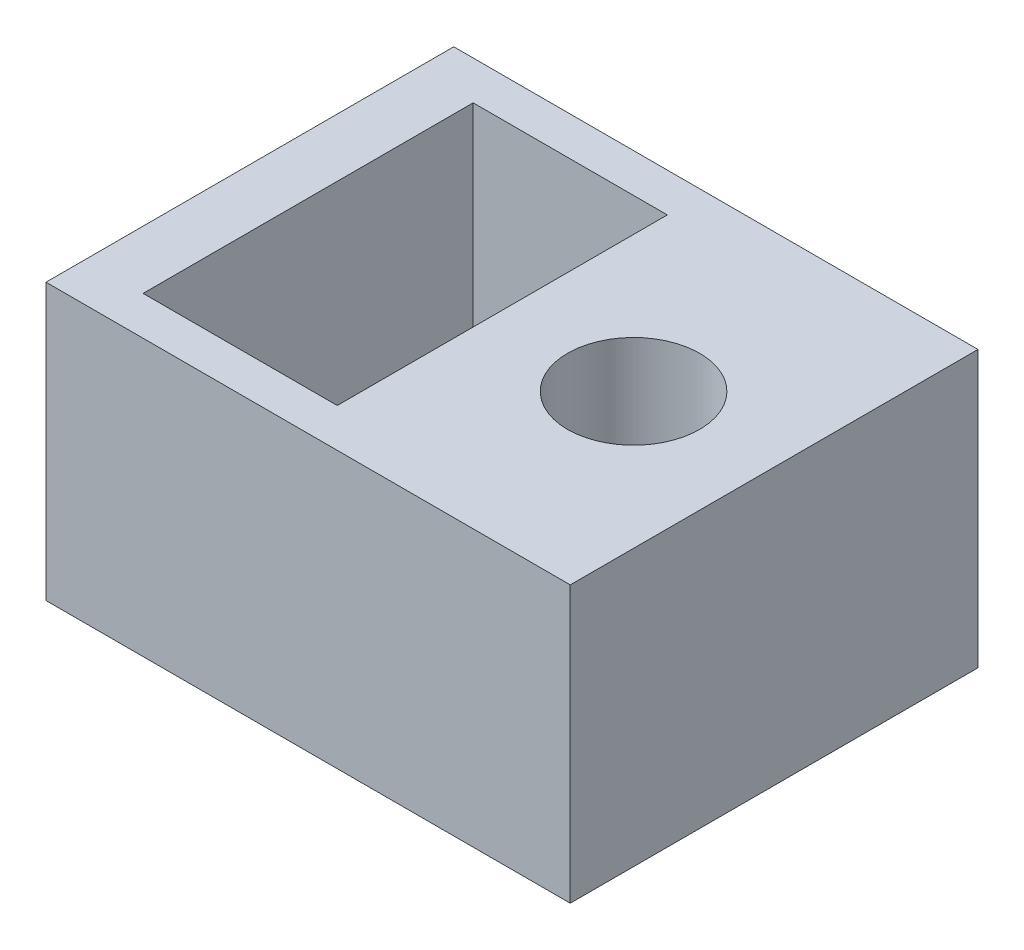
ISO-10303-21;
HEADER;
FILE_DESCRIPTION(('STEP AP214'),'2;1');
FILE_NAME('part.step','',(''),(''),'','','');
FILE_SCHEMA(('AUTOMOTIVE_DESIGN { 1 0 10303 214 1 1 1 1 }'));
ENDSEC;
DATA;
#1=APPLICATION_CONTEXT('core data for automotive mechanical design processes');
#2=APPLICATION_PROTOCOL_DEFINITION('international standard','automotive_design',2000,#1);
#3=PRODUCT_CONTEXT('',#1,'mechanical');
#4=PRODUCT('Part','Part','',(#3));
#5=PRODUCT_RELATED_PRODUCT_CATEGORY('part','',(#4));
#6=PRODUCT_DEFINITION_FORMATION('','',#4);
#7=PRODUCT_DEFINITION_CONTEXT('part definition',#1,'design');
#8=PRODUCT_DEFINITION('design','',#6,#7);
#9=PRODUCT_DEFINITION_SHAPE('','',#8);
#10=(LENGTH_UNIT() NAMED_UNIT(*) SI_UNIT(.MILLI.,.METRE.));
#11=(NAMED_UNIT(*) PLANE_ANGLE_UNIT() SI_UNIT($,.RADIAN.));
#12=(NAMED_UNIT(*) SI_UNIT($,.STERADIAN.) SOLID_ANGLE_UNIT());
#13=UNCERTAINTY_MEASURE_WITH_UNIT(LENGTH_MEASURE(1.E-05),#10,'distance_accuracy_value','');
#14=(GEOMETRIC_REPRESENTATION_CONTEXT(3) GLOBAL_UNCERTAINTY_ASSIGNED_CONTEXT((#13)) GLOBAL_UNIT_ASSIGNED_CONTEXT((#10,
#11,#12)) REPRESENTATION_CONTEXT('',''));
#15=CARTESIAN_POINT('',(0.,0.,0.));
#16=DIRECTION('',(0.,0.,1.));
#17=DIRECTION('',(1.,0.,0.));
#18=AXIS2_PLACEMENT_3D('',#15,#16,#17);
#19=CARTESIAN_POINT('',(0.,7.1,0.));
#20=DIRECTION('',(0.,-1.,0.));
#21=DIRECTION('',(0.,0.,-1.));
#22=AXIS2_PLACEMENT_3D('',#19,#20,#21);
#23=PLANE('',#22);
#24=DIRECTION('',(0.,0.,1.));
#25=VECTOR('',#24,1.);
#26=CARTESIAN_POINT('',(9.60529294047567,7.1,-2.45570042210062));
#27=LINE('',#26,#25);
#28=CARTESIAN_POINT('',(9.60529294047567,7.1,-2.45570042210062));
#29=VERTEX_POINT('',#28);
#30=CARTESIAN_POINT('',(9.60529294047568,7.1,6.04429957789938));
#31=VERTEX_POINT('',#30);
#32=EDGE_CURVE('E147',#29,#31,#27,.T.);
#33=ORIENTED_EDGE('',*,*,#32,.F.);
#34=DIRECTION('',(-1.,0.,0.));
#35=VECTOR('',#34,1.);
#36=CARTESIAN_POINT('',(14.6052929404757,7.1,-2.45570042210062));
#37=LINE('',#36,#35);
#38=CARTESIAN_POINT('',(14.6052929404757,7.1,-2.45570042210062));
#39=VERTEX_POINT('',#38);
#40=EDGE_CURVE('E140',#39,#29,#37,.T.);
#41=ORIENTED_EDGE('',*,*,#40,.F.);
#42=DIRECTION('',(0.,0.,-1.));
#43=VECTOR('',#42,1.);
#44=CARTESIAN_POINT('',(14.6052929404757,7.1,6.04429957789938));
#45=LINE('',#44,#43);
#46=CARTESIAN_POINT('',(14.6052929404757,7.1,6.04429957789938));
#47=VERTEX_POINT('',#46);
#48=EDGE_CURVE('E151',#47,#39,#45,.T.);
#49=ORIENTED_EDGE('',*,*,#48,.F.);
#50=DIRECTION('',(1.,0.,0.));
#51=VECTOR('',#50,1.);
#52=CARTESIAN_POINT('',(9.60529294047568,7.1,6.04429957789938));
#53=LINE('',#52,#51);
#54=EDGE_CURVE('E50',#31,#47,#53,.T.);
#55=ORIENTED_EDGE('',*,*,#54,.F.);
#56=EDGE_LOOP('',(#33,#41,#49,#55));
#57=FACE_BOUND('',#56,.T.);
#58=CARTESIAN_POINT('',(18.1052929404757,7.1,1.91320120605374));
#59=DIRECTION('',(0.,1.,0.));
#60=DIRECTION('',(0.,0.,1.));
#61=AXIS2_PLACEMENT_3D('',#58,#59,#60);
#62=CIRCLE('',#61,1.7);
#63=CARTESIAN_POINT('',(18.1052929404757,7.1,3.61320120605374));
#64=VERTEX_POINT('',#63);
#65=EDGE_CURVE('E187',#64,#64,#62,.T.);
#66=ORIENTED_EDGE('',*,*,#65,.F.);
#67=EDGE_LOOP('',(#66));
#68=FACE_BOUND('',#67,.T.);
#69=DIRECTION('',(0.,0.,1.));
#70=VECTOR('',#69,1.);
#71=CARTESIAN_POINT('',(8.10529294047567,7.1,7.04429957789938));
#72=LINE('',#71,#70);
#73=CARTESIAN_POINT('',(8.10529294047567,7.1,-3.45570042210062));
#74=VERTEX_POINT('',#73);
#75=CARTESIAN_POINT('',(8.10529294047567,7.1,7.04429957789938));
#76=VERTEX_POINT('',#75);
#77=EDGE_CURVE('E193',#74,#76,#72,.T.);
#78=ORIENTED_EDGE('',*,*,#77,.T.);
#79=DIRECTION('',(1.,0.,0.));
#80=VECTOR('',#79,1.);
#81=CARTESIAN_POINT('',(8.10529294047567,7.1,7.04429957789938));
#82=LINE('',#81,#80);
#83=CARTESIAN_POINT('',(21.6052929404757,7.1,7.04429957789938));
#84=VERTEX_POINT('',#83);
#85=EDGE_CURVE('E196',#76,#84,#82,.T.);
#86=ORIENTED_EDGE('',*,*,#85,.T.);
#87=DIRECTION('',(0.,0.,-1.));
#88=VECTOR('',#87,1.);
#89=CARTESIAN_POINT('',(21.6052929404757,7.1,7.04429957789938));
#90=LINE('',#89,#88);
#91=CARTESIAN_POINT('',(21.6052929404757,7.1,-3.45570042210062));
#92=VERTEX_POINT('',#91);
#93=EDGE_CURVE('E199',#84,#92,#90,.T.);
#94=ORIENTED_EDGE('',*,*,#93,.T.);
#95=DIRECTION('',(-1.,0.,0.));
#96=VECTOR('',#95,1.);
#97=CARTESIAN_POINT('',(8.10529294047567,7.1,-3.45570042210062));
#98=LINE('',#97,#96);
#99=EDGE_CURVE('E201',#92,#74,#98,.T.);
#100=ORIENTED_EDGE('',*,*,#99,.T.);
#101=EDGE_LOOP('',(#78,#86,#94,#100));
#102=FACE_BOUND('',#101,.T.);
#103=ADVANCED_FACE('F35',(#57,#68,#102),#23,.F.);
#104=CARTESIAN_POINT('',(0.,0.,0.));
#105=DIRECTION('',(0.,-1.,0.));
#106=DIRECTION('',(0.,0.,-1.));
#107=AXIS2_PLACEMENT_3D('',#104,#105,#106);
#108=PLANE('',#107);
#109=DIRECTION('',(0.,0.,1.));
#110=VECTOR('',#109,1.);
#111=CARTESIAN_POINT('',(8.10529294047567,0.,7.04429957789938));
#112=LINE('',#111,#110);
#113=CARTESIAN_POINT('',(8.10529294047567,0.,-3.45570042210062));
#114=VERTEX_POINT('',#113);
#115=CARTESIAN_POINT('',(8.10529294047567,0.,7.04429957789938));
#116=VERTEX_POINT('',#115);
#117=EDGE_CURVE('E190',#114,#116,#112,.T.);
#118=ORIENTED_EDGE('',*,*,#117,.F.);
#119=DIRECTION('',(-1.,0.,0.));
#120=VECTOR('',#119,1.);
#121=CARTESIAN_POINT('',(8.10529294047567,0.,-3.45570042210062));
#122=LINE('',#121,#120);
#123=CARTESIAN_POINT('',(21.6052929404757,0.,-3.45570042210062));
#124=VERTEX_POINT('',#123);
#125=EDGE_CURVE('E197',#124,#114,#122,.T.);
#126=ORIENTED_EDGE('',*,*,#125,.F.);
#127=DIRECTION('',(0.,0.,-1.));
#128=VECTOR('',#127,1.);
#129=CARTESIAN_POINT('',(21.6052929404757,0.,7.04429957789938));
#130=LINE('',#129,#128);
#131=CARTESIAN_POINT('',(21.6052929404757,0.,7.04429957789938));
#132=VERTEX_POINT('',#131);
#133=EDGE_CURVE('E208',#132,#124,#130,.T.);
#134=ORIENTED_EDGE('',*,*,#133,.F.);
#135=DIRECTION('',(1.,0.,0.));
#136=VECTOR('',#135,1.);
#137=CARTESIAN_POINT('',(8.10529294047567,0.,7.04429957789938));
#138=LINE('',#137,#136);
#139=EDGE_CURVE('E206',#116,#132,#138,.T.);
#140=ORIENTED_EDGE('',*,*,#139,.F.);
#141=EDGE_LOOP('',(#118,#126,#134,#140));
#142=FACE_BOUND('',#141,.T.);
#143=CARTESIAN_POINT('',(18.1052929404757,0.,1.91320120605374));
#144=DIRECTION('',(0.,1.,0.));
#145=DIRECTION('',(0.,0.,1.));
#146=AXIS2_PLACEMENT_3D('',#143,#144,#145);
#147=CIRCLE('',#146,1.7);
#148=CARTESIAN_POINT('',(18.1052929404757,0.,3.61320120605374));
#149=VERTEX_POINT('',#148);
#150=EDGE_CURVE('E186',#149,#149,#147,.T.);
#151=ORIENTED_EDGE('',*,*,#150,.T.);
#152=EDGE_LOOP('',(#151));
#153=FACE_BOUND('',#152,.T.);
#154=DIRECTION('',(0.,0.,-1.));
#155=VECTOR('',#154,1.);
#156=CARTESIAN_POINT('',(13.6052929404757,0.,-1.45570042210062));
#157=LINE('',#156,#155);
#158=CARTESIAN_POINT('',(13.6052929404757,0.,5.04429957789938));
#159=VERTEX_POINT('',#158);
#160=CARTESIAN_POINT('',(13.6052929404757,0.,-1.45570042210062));
#161=VERTEX_POINT('',#160);
#162=EDGE_CURVE('E175',#159,#161,#157,.T.);
#163=ORIENTED_EDGE('',*,*,#162,.T.);
#164=DIRECTION('',(-1.,0.,0.));
#165=VECTOR('',#164,1.);
#166=CARTESIAN_POINT('',(10.6052929404757,0.,-1.45570042210062));
#167=LINE('',#166,#165);
#168=CARTESIAN_POINT('',(10.6052929404757,0.,-1.45570042210062));
#169=VERTEX_POINT('',#168);
#170=EDGE_CURVE('E166',#161,#169,#167,.T.);
#171=ORIENTED_EDGE('',*,*,#170,.T.);
#172=DIRECTION('',(0.,0.,1.));
#173=VECTOR('',#172,1.);
#174=CARTESIAN_POINT('',(10.6052929404757,0.,-1.45570042210062));
#175=LINE('',#174,#173);
#176=CARTESIAN_POINT('',(10.6052929404757,0.,5.04429957789938));
#177=VERTEX_POINT('',#176);
#178=EDGE_CURVE('E169',#169,#177,#175,.T.);
#179=ORIENTED_EDGE('',*,*,#178,.T.);
#180=DIRECTION('',(1.,0.,0.));
#181=VECTOR('',#180,1.);
#182=CARTESIAN_POINT('',(10.6052929404757,0.,5.04429957789938));
#183=LINE('',#182,#181);
#184=EDGE_CURVE('E172',#177,#159,#183,.T.);
#185=ORIENTED_EDGE('',*,*,#184,.T.);
#186=EDGE_LOOP('',(#163,#171,#179,#185));
#187=FACE_BOUND('',#186,.T.);
#188=ADVANCED_FACE('F229',(#142,#153,#187),#108,.T.);
#189=CARTESIAN_POINT('',(8.10529294047567,7.1,7.04429957789938));
#190=DIRECTION('',(1.,0.,0.));
#191=DIRECTION('',(0.,0.,-1.));
#192=AXIS2_PLACEMENT_3D('',#189,#190,#191);
#193=PLANE('',#192);
#194=ORIENTED_EDGE('',*,*,#117,.T.);
#195=DIRECTION('',(0.,-1.,0.));
#196=VECTOR('',#195,1.);
#197=CARTESIAN_POINT('',(8.10529294047567,7.1,7.04429957789938));
#198=LINE('',#197,#196);
#199=EDGE_CURVE('E43',#76,#116,#198,.T.);
#200=ORIENTED_EDGE('',*,*,#199,.F.);
#201=ORIENTED_EDGE('',*,*,#77,.F.);
#202=DIRECTION('',(0.,-1.,0.));
#203=VECTOR('',#202,1.);
#204=CARTESIAN_POINT('',(8.10529294047567,7.1,-3.45570042210062));
#205=LINE('',#204,#203);
#206=EDGE_CURVE('E203',#74,#114,#205,.T.);
#207=ORIENTED_EDGE('',*,*,#206,.T.);
#208=EDGE_LOOP('',(#194,#200,#201,#207));
#209=FACE_BOUND('',#208,.T.);
#210=ADVANCED_FACE('F37',(#209),#193,.F.);
#211=CARTESIAN_POINT('',(8.10529294047567,7.1,7.04429957789938));
#212=DIRECTION('',(0.,0.,-1.));
#213=DIRECTION('',(-1.,0.,0.));
#214=AXIS2_PLACEMENT_3D('',#211,#212,#213);
#215=PLANE('',#214);
#216=ORIENTED_EDGE('',*,*,#139,.T.);
#217=DIRECTION('',(0.,-1.,0.));
#218=VECTOR('',#217,1.);
#219=CARTESIAN_POINT('',(21.6052929404757,7.1,7.04429957789938));
#220=LINE('',#219,#218);
#221=EDGE_CURVE('E216',#84,#132,#220,.T.);
#222=ORIENTED_EDGE('',*,*,#221,.F.);
#223=ORIENTED_EDGE('',*,*,#85,.F.);
#224=ORIENTED_EDGE('',*,*,#199,.T.);
#225=EDGE_LOOP('',(#216,#222,#223,#224));
#226=FACE_BOUND('',#225,.T.);
#227=ADVANCED_FACE('F221',(#226),#215,.F.);
#228=CARTESIAN_POINT('',(21.6052929404757,7.1,7.04429957789938));
#229=DIRECTION('',(-1.,0.,0.));
#230=DIRECTION('',(0.,0.,1.));
#231=AXIS2_PLACEMENT_3D('',#228,#229,#230);
#232=PLANE('',#231);
#233=ORIENTED_EDGE('',*,*,#133,.T.);
#234=DIRECTION('',(0.,-1.,0.));
#235=VECTOR('',#234,1.);
#236=CARTESIAN_POINT('',(21.6052929404757,7.1,-3.45570042210062));
#237=LINE('',#236,#235);
#238=EDGE_CURVE('E213',#92,#124,#237,.T.);
#239=ORIENTED_EDGE('',*,*,#238,.F.);
#240=ORIENTED_EDGE('',*,*,#93,.F.);
#241=ORIENTED_EDGE('',*,*,#221,.T.);
#242=EDGE_LOOP('',(#233,#239,#240,#241));
#243=FACE_BOUND('',#242,.T.);
#244=ADVANCED_FACE('F234',(#243),#232,.F.);
#245=CARTESIAN_POINT('',(8.10529294047567,7.1,-3.45570042210062));
#246=DIRECTION('',(0.,0.,1.));
#247=DIRECTION('',(1.,0.,0.));
#248=AXIS2_PLACEMENT_3D('',#245,#246,#247);
#249=PLANE('',#248);
#250=ORIENTED_EDGE('',*,*,#125,.T.);
#251=ORIENTED_EDGE('',*,*,#206,.F.);
#252=ORIENTED_EDGE('',*,*,#99,.F.);
#253=ORIENTED_EDGE('',*,*,#238,.T.);
#254=EDGE_LOOP('',(#250,#251,#252,#253));
#255=FACE_BOUND('',#254,.T.);
#256=ADVANCED_FACE('F238',(#255),#249,.F.);
#257=CARTESIAN_POINT('',(18.1052929404757,7.1,1.91320120605374));
#258=DIRECTION('',(0.,-1.,0.));
#259=DIRECTION('',(0.,0.,-1.));
#260=AXIS2_PLACEMENT_3D('',#257,#258,#259);
#261=CYLINDRICAL_SURFACE('',#260,1.7);
#262=ORIENTED_EDGE('',*,*,#65,.T.);
#263=EDGE_LOOP('',(#262));
#264=FACE_BOUND('',#263,.T.);
#265=ORIENTED_EDGE('',*,*,#150,.F.);
#266=EDGE_LOOP('',(#265));
#267=FACE_BOUND('',#266,.T.);
#268=ADVANCED_FACE('F249',(#264,#267),#261,.F.);
#269=CARTESIAN_POINT('',(10.6052929404757,7.1,-1.45570042210062));
#270=DIRECTION('',(0.,0.,1.));
#271=DIRECTION('',(1.,0.,0.));
#272=AXIS2_PLACEMENT_3D('',#269,#270,#271);
#273=PLANE('',#272);
#274=DIRECTION('',(1.,0.,0.));
#275=VECTOR('',#274,1.);
#276=CARTESIAN_POINT('',(10.6052929404757,2.,-1.45570042210062));
#277=LINE('',#276,#275);
#278=CARTESIAN_POINT('',(10.6052929404757,2.,-1.45570042210062));
#279=VERTEX_POINT('',#278);
#280=CARTESIAN_POINT('',(13.6052929404757,2.,-1.45570042210062));
#281=VERTEX_POINT('',#280);
#282=EDGE_CURVE('E57',#279,#281,#277,.T.);
#283=ORIENTED_EDGE('',*,*,#282,.F.);
#284=DIRECTION('',(0.,-1.,0.));
#285=VECTOR('',#284,1.);
#286=CARTESIAN_POINT('',(10.6052929404757,7.1,-1.45570042210062));
#287=LINE('',#286,#285);
#288=EDGE_CURVE('E184',#279,#169,#287,.T.);
#289=ORIENTED_EDGE('',*,*,#288,.T.);
#290=ORIENTED_EDGE('',*,*,#170,.F.);
#291=DIRECTION('',(0.,-1.,0.));
#292=VECTOR('',#291,1.);
#293=CARTESIAN_POINT('',(13.6052929404757,7.1,-1.45570042210062));
#294=LINE('',#293,#292);
#295=EDGE_CURVE('E178',#281,#161,#294,.T.);
#296=ORIENTED_EDGE('',*,*,#295,.F.);
#297=EDGE_LOOP('',(#283,#289,#290,#296));
#298=FACE_BOUND('',#297,.T.);
#299=ADVANCED_FACE('F294',(#298),#273,.T.);
#300=CARTESIAN_POINT('',(10.6052929404757,7.1,-1.45570042210062));
#301=DIRECTION('',(1.,0.,0.));
#302=DIRECTION('',(0.,0.,-1.));
#303=AXIS2_PLACEMENT_3D('',#300,#301,#302);
#304=PLANE('',#303);
#305=DIRECTION('',(0.,0.,-1.));
#306=VECTOR('',#305,1.);
#307=CARTESIAN_POINT('',(10.6052929404757,2.,-1.45570042210062));
#308=LINE('',#307,#306);
#309=CARTESIAN_POINT('',(10.6052929404757,2.,5.04429957789938));
#310=VERTEX_POINT('',#309);
#311=EDGE_CURVE('E163',#310,#279,#308,.T.);
#312=ORIENTED_EDGE('',*,*,#311,.F.);
#313=DIRECTION('',(0.,-1.,0.));
#314=VECTOR('',#313,1.);
#315=CARTESIAN_POINT('',(10.6052929404757,7.1,5.04429957789938));
#316=LINE('',#315,#314);
#317=EDGE_CURVE('E182',#310,#177,#316,.T.);
#318=ORIENTED_EDGE('',*,*,#317,.T.);
#319=ORIENTED_EDGE('',*,*,#178,.F.);
#320=ORIENTED_EDGE('',*,*,#288,.F.);
#321=EDGE_LOOP('',(#312,#318,#319,#320));
#322=FACE_BOUND('',#321,.T.);
#323=ADVANCED_FACE('F302',(#322),#304,.T.);
#324=CARTESIAN_POINT('',(10.6052929404757,7.1,5.04429957789938));
#325=DIRECTION('',(0.,0.,-1.));
#326=DIRECTION('',(-1.,0.,0.));
#327=AXIS2_PLACEMENT_3D('',#324,#325,#326);
#328=PLANE('',#327);
#329=DIRECTION('',(-1.,0.,0.));
#330=VECTOR('',#329,1.);
#331=CARTESIAN_POINT('',(10.6052929404757,2.,5.04429957789938));
#332=LINE('',#331,#330);
#333=CARTESIAN_POINT('',(13.6052929404757,2.,5.04429957789938));
#334=VERTEX_POINT('',#333);
#335=EDGE_CURVE('E161',#334,#310,#332,.T.);
#336=ORIENTED_EDGE('',*,*,#335,.F.);
#337=DIRECTION('',(0.,-1.,0.));
#338=VECTOR('',#337,1.);
#339=CARTESIAN_POINT('',(13.6052929404757,7.1,5.04429957789938));
#340=LINE('',#339,#338);
#341=EDGE_CURVE('E180',#334,#159,#340,.T.);
#342=ORIENTED_EDGE('',*,*,#341,.T.);
#343=ORIENTED_EDGE('',*,*,#184,.F.);
#344=ORIENTED_EDGE('',*,*,#317,.F.);
#345=EDGE_LOOP('',(#336,#342,#343,#344));
#346=FACE_BOUND('',#345,.T.);
#347=ADVANCED_FACE('F310',(#346),#328,.T.);
#348=CARTESIAN_POINT('',(13.6052929404757,7.1,-1.45570042210062));
#349=DIRECTION('',(-1.,0.,0.));
#350=DIRECTION('',(0.,0.,1.));
#351=AXIS2_PLACEMENT_3D('',#348,#349,#350);
#352=PLANE('',#351);
#353=DIRECTION('',(0.,0.,1.));
#354=VECTOR('',#353,1.);
#355=CARTESIAN_POINT('',(13.6052929404757,2.,-1.45570042210062));
#356=LINE('',#355,#354);
#357=EDGE_CURVE('E12',#281,#334,#356,.T.);
#358=ORIENTED_EDGE('',*,*,#357,.F.);
#359=ORIENTED_EDGE('',*,*,#295,.T.);
#360=ORIENTED_EDGE('',*,*,#162,.F.);
#361=ORIENTED_EDGE('',*,*,#341,.F.);
#362=EDGE_LOOP('',(#358,#359,#360,#361));
#363=FACE_BOUND('',#362,.T.);
#364=ADVANCED_FACE('F319',(#363),#352,.T.);
#365=CARTESIAN_POINT('',(0.,2.,0.));
#366=DIRECTION('',(0.,-1.,0.));
#367=DIRECTION('',(0.,0.,-1.));
#368=AXIS2_PLACEMENT_3D('',#365,#366,#367);
#369=PLANE('',#368);
#370=ORIENTED_EDGE('',*,*,#282,.T.);
#371=ORIENTED_EDGE('',*,*,#357,.T.);
#372=ORIENTED_EDGE('',*,*,#335,.T.);
#373=ORIENTED_EDGE('',*,*,#311,.T.);
#374=EDGE_LOOP('',(#370,#371,#372,#373));
#375=FACE_BOUND('',#374,.T.);
#376=DIRECTION('',(0.,0.,-1.));
#377=VECTOR('',#376,1.);
#378=CARTESIAN_POINT('',(14.6052929404757,2.,6.04429957789938));
#379=LINE('',#378,#377);
#380=CARTESIAN_POINT('',(14.6052929404757,2.,6.04429957789938));
#381=VERTEX_POINT('',#380);
#382=CARTESIAN_POINT('',(14.6052929404757,2.,-2.45570042210062));
#383=VERTEX_POINT('',#382);
#384=EDGE_CURVE('E144',#381,#383,#379,.T.);
#385=ORIENTED_EDGE('',*,*,#384,.T.);
#386=DIRECTION('',(-1.,0.,0.));
#387=VECTOR('',#386,1.);
#388=CARTESIAN_POINT('',(14.6052929404757,2.,-2.45570042210062));
#389=LINE('',#388,#387);
#390=CARTESIAN_POINT('',(9.60529294047567,2.,-2.45570042210062));
#391=VERTEX_POINT('',#390);
#392=EDGE_CURVE('E137',#383,#391,#389,.T.);
#393=ORIENTED_EDGE('',*,*,#392,.T.);
#394=DIRECTION('',(0.,0.,1.));
#395=VECTOR('',#394,1.);
#396=CARTESIAN_POINT('',(9.60529294047567,2.,-2.45570042210062));
#397=LINE('',#396,#395);
#398=CARTESIAN_POINT('',(9.60529294047568,2.,6.04429957789938));
#399=VERTEX_POINT('',#398);
#400=EDGE_CURVE('E124',#391,#399,#397,.T.);
#401=ORIENTED_EDGE('',*,*,#400,.T.);
#402=DIRECTION('',(1.,0.,0.));
#403=VECTOR('',#402,1.);
#404=CARTESIAN_POINT('',(9.60529294047568,2.,6.04429957789938));
#405=LINE('',#404,#403);
#406=EDGE_CURVE('E156',#399,#381,#405,.T.);
#407=ORIENTED_EDGE('',*,*,#406,.T.);
#408=EDGE_LOOP('',(#385,#393,#401,#407));
#409=FACE_BOUND('',#408,.T.);
#410=ADVANCED_FACE('F143',(#375,#409),#369,.F.);
#411=CARTESIAN_POINT('',(14.6052929404757,-9.86154146165801,-2.45570042210062));
#412=DIRECTION('',(0.,0.,-1.));
#413=DIRECTION('',(-1.,0.,0.));
#414=AXIS2_PLACEMENT_3D('',#411,#412,#413);
#415=PLANE('',#414);
#416=DIRECTION('',(0.,1.,0.));
#417=VECTOR('',#416,1.);
#418=CARTESIAN_POINT('',(14.6052929404757,-9.86154146165801,-2.45570042210062));
#419=LINE('',#418,#417);
#420=EDGE_CURVE('E154',#383,#39,#419,.T.);
#421=ORIENTED_EDGE('',*,*,#420,.T.);
#422=ORIENTED_EDGE('',*,*,#40,.T.);
#423=DIRECTION('',(0.,1.,0.));
#424=VECTOR('',#423,1.);
#425=CARTESIAN_POINT('',(9.60529294047567,-9.86154146165801,-2.45570042210062));
#426=LINE('',#425,#424);
#427=EDGE_CURVE('E128',#391,#29,#426,.T.);
#428=ORIENTED_EDGE('',*,*,#427,.F.);
#429=ORIENTED_EDGE('',*,*,#392,.F.);
#430=EDGE_LOOP('',(#421,#422,#428,#429));
#431=FACE_BOUND('',#430,.T.);
#432=ADVANCED_FACE('F136',(#431),#415,.F.);
#433=CARTESIAN_POINT('',(9.60529294047567,-9.86154146165801,-2.45570042210062));
#434=DIRECTION('',(-1.,0.,0.));
#435=DIRECTION('',(0.,0.,1.));
#436=AXIS2_PLACEMENT_3D('',#433,#434,#435);
#437=PLANE('',#436);
#438=ORIENTED_EDGE('',*,*,#427,.T.);
#439=ORIENTED_EDGE('',*,*,#32,.T.);
#440=DIRECTION('',(0.,1.,0.));
#441=VECTOR('',#440,1.);
#442=CARTESIAN_POINT('',(9.60529294047568,-9.86154146165801,6.04429957789938));
#443=LINE('',#442,#441);
#444=EDGE_CURVE('E130',#399,#31,#443,.T.);
#445=ORIENTED_EDGE('',*,*,#444,.F.);
#446=ORIENTED_EDGE('',*,*,#400,.F.);
#447=EDGE_LOOP('',(#438,#439,#445,#446));
#448=FACE_BOUND('',#447,.T.);
#449=ADVANCED_FACE('F126',(#448),#437,.F.);
#450=CARTESIAN_POINT('',(9.60529294047568,-9.86154146165801,6.04429957789938));
#451=DIRECTION('',(0.,0.,1.));
#452=DIRECTION('',(1.,0.,0.));
#453=AXIS2_PLACEMENT_3D('',#450,#451,#452);
#454=PLANE('',#453);
#455=ORIENTED_EDGE('',*,*,#444,.T.);
#456=ORIENTED_EDGE('',*,*,#54,.T.);
#457=DIRECTION('',(0.,1.,0.));
#458=VECTOR('',#457,1.);
#459=CARTESIAN_POINT('',(14.6052929404757,-9.86154146165801,6.04429957789938));
#460=LINE('',#459,#458);
#461=EDGE_CURVE('E155',#381,#47,#460,.T.);
#462=ORIENTED_EDGE('',*,*,#461,.F.);
#463=ORIENTED_EDGE('',*,*,#406,.F.);
#464=EDGE_LOOP('',(#455,#456,#462,#463));
#465=FACE_BOUND('',#464,.T.);
#466=ADVANCED_FACE('F350',(#465),#454,.F.);
#467=CARTESIAN_POINT('',(14.6052929404757,-9.86154146165801,6.04429957789938));
#468=DIRECTION('',(1.,0.,0.));
#469=DIRECTION('',(0.,0.,-1.));
#470=AXIS2_PLACEMENT_3D('',#467,#468,#469);
#471=PLANE('',#470);
#472=ORIENTED_EDGE('',*,*,#461,.T.);
#473=ORIENTED_EDGE('',*,*,#48,.T.);
#474=ORIENTED_EDGE('',*,*,#420,.F.);
#475=ORIENTED_EDGE('',*,*,#384,.F.);
#476=EDGE_LOOP('',(#472,#473,#474,#475));
#477=FACE_BOUND('',#476,.T.);
#478=ADVANCED_FACE('F358',(#477),#471,.F.);
#479=CLOSED_SHELL('',(#103,#188,#210,#227,#244,#256,#268,#299,#323,#347,#364,#410,#432,#449,
#466,#478));
#480=MANIFOLD_SOLID_BREP('B2',#479);
#481=ADVANCED_BREP_SHAPE_REPRESENTATION('',(#18,#480),#14);
#482=SHAPE_DEFINITION_REPRESENTATION(#9,#481);
ENDSEC;
END-ISO-10303-21;
